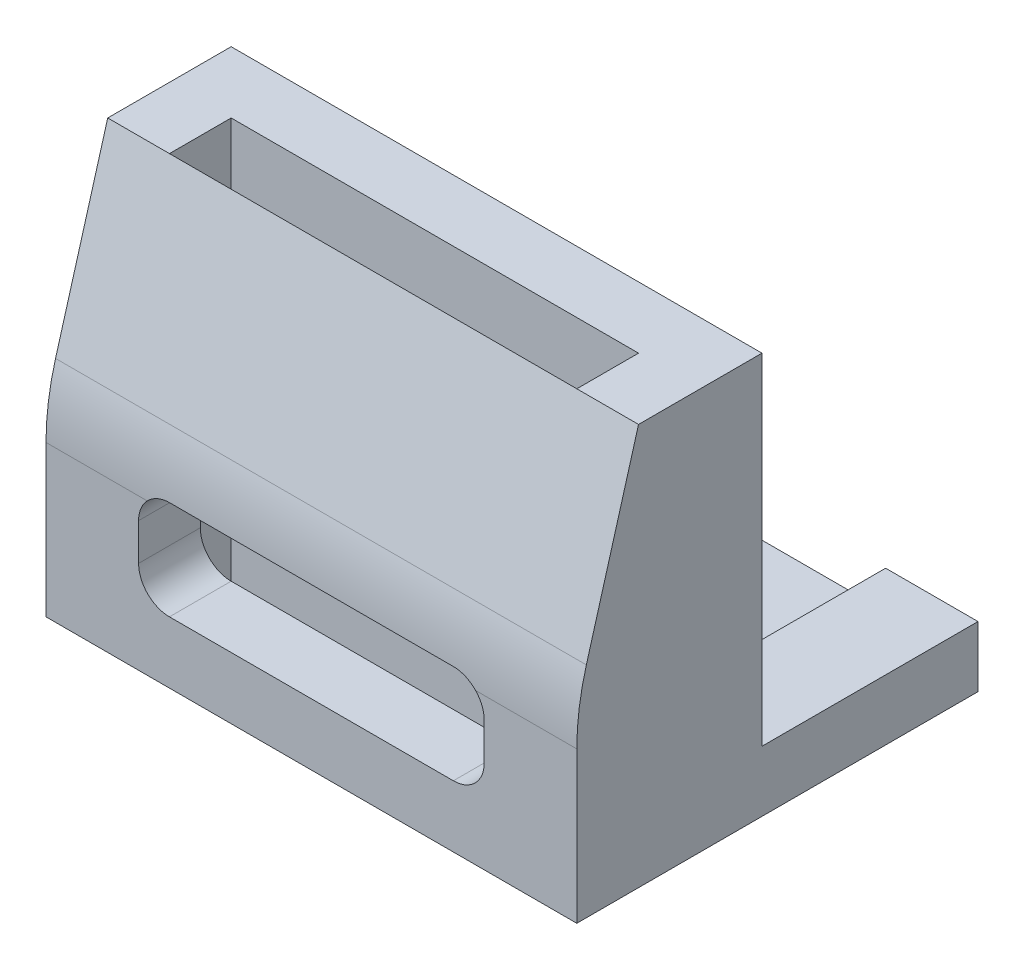
ISO-10303-21;
HEADER;
FILE_DESCRIPTION(('STEP AP214'),'2;1');
FILE_NAME('part.step','',(''),(''),'','','');
FILE_SCHEMA(('AUTOMOTIVE_DESIGN { 1 0 10303 214 1 1 1 1 }'));
ENDSEC;
DATA;
#1=APPLICATION_CONTEXT('core data for automotive mechanical design processes');
#2=APPLICATION_PROTOCOL_DEFINITION('international standard','automotive_design',2000,#1);
#3=PRODUCT_CONTEXT('',#1,'mechanical');
#4=PRODUCT('Part','Part','',(#3));
#5=PRODUCT_RELATED_PRODUCT_CATEGORY('part','',(#4));
#6=PRODUCT_DEFINITION_FORMATION('','',#4);
#7=PRODUCT_DEFINITION_CONTEXT('part definition',#1,'design');
#8=PRODUCT_DEFINITION('design','',#6,#7);
#9=PRODUCT_DEFINITION_SHAPE('','',#8);
#10=(LENGTH_UNIT() NAMED_UNIT(*) SI_UNIT(.MILLI.,.METRE.));
#11=(NAMED_UNIT(*) PLANE_ANGLE_UNIT() SI_UNIT($,.RADIAN.));
#12=(NAMED_UNIT(*) SI_UNIT($,.STERADIAN.) SOLID_ANGLE_UNIT());
#13=UNCERTAINTY_MEASURE_WITH_UNIT(LENGTH_MEASURE(1.E-05),#10,'distance_accuracy_value','');
#14=(GEOMETRIC_REPRESENTATION_CONTEXT(3) GLOBAL_UNCERTAINTY_ASSIGNED_CONTEXT((#13)) GLOBAL_UNIT_ASSIGNED_CONTEXT((#10,
#11,#12)) REPRESENTATION_CONTEXT('',''));
#15=CARTESIAN_POINT('',(0.,0.,0.));
#16=DIRECTION('',(0.,0.,1.));
#17=DIRECTION('',(1.,0.,0.));
#18=AXIS2_PLACEMENT_3D('',#15,#16,#17);
#19=CARTESIAN_POINT('',(15.2,1.96895504732383,-11.));
#20=DIRECTION('',(0.,-1.,0.));
#21=DIRECTION('',(0.,0.,-1.));
#22=AXIS2_PLACEMENT_3D('',#19,#20,#21);
#23=PLANE('',#22);
#24=DIRECTION('',(1.,0.,0.));
#25=VECTOR('',#24,1.);
#26=CARTESIAN_POINT('',(15.2,1.96895504732383,-4.));
#27=LINE('',#26,#25);
#28=CARTESIAN_POINT('',(-2.,1.96895504732383,-4.));
#29=VERTEX_POINT('',#28);
#30=CARTESIAN_POINT('',(1.,1.96895504732383,-4.));
#31=VERTEX_POINT('',#30);
#32=EDGE_CURVE('E493',#29,#31,#27,.T.);
#33=ORIENTED_EDGE('',*,*,#32,.T.);
#34=DIRECTION('',(0.,0.,-1.));
#35=VECTOR('',#34,1.);
#36=CARTESIAN_POINT('',(1.,1.96895504732383,-11.));
#37=LINE('',#36,#35);
#38=CARTESIAN_POINT('',(1.,1.96895504732383,-11.));
#39=VERTEX_POINT('',#38);
#40=EDGE_CURVE('E479',#31,#39,#37,.T.);
#41=ORIENTED_EDGE('',*,*,#40,.T.);
#42=DIRECTION('',(1.,0.,0.));
#43=VECTOR('',#42,1.);
#44=CARTESIAN_POINT('',(15.2,1.96895504732383,-11.));
#45=LINE('',#44,#43);
#46=CARTESIAN_POINT('',(-2.,1.96895504732383,-11.));
#47=VERTEX_POINT('',#46);
#48=EDGE_CURVE('E501',#47,#39,#45,.T.);
#49=ORIENTED_EDGE('',*,*,#48,.F.);
#50=DIRECTION('',(0.,0.,1.));
#51=VECTOR('',#50,1.);
#52=CARTESIAN_POINT('',(-2.,1.96895504732383,-11.));
#53=LINE('',#52,#51);
#54=EDGE_CURVE('E440',#47,#29,#53,.T.);
#55=ORIENTED_EDGE('',*,*,#54,.T.);
#56=EDGE_LOOP('',(#33,#41,#49,#55));
#57=FACE_BOUND('',#56,.T.);
#58=ADVANCED_FACE('F39',(#57),#23,.F.);
#59=CARTESIAN_POINT('',(-2.,13.,-4.));
#60=DIRECTION('',(0.,0.,1.));
#61=DIRECTION('',(1.,0.,0.));
#62=AXIS2_PLACEMENT_3D('',#59,#60,#61);
#63=PLANE('',#62);
#64=DIRECTION('',(0.,1.,0.));
#65=VECTOR('',#64,1.);
#66=CARTESIAN_POINT('',(1.,0.752448814893286,-4.));
#67=LINE('',#66,#65);
#68=CARTESIAN_POINT('',(1.,0.752448814893286,-4.));
#69=VERTEX_POINT('',#68);
#70=EDGE_CURVE('E467',#69,#31,#67,.T.);
#71=ORIENTED_EDGE('',*,*,#70,.T.);
#72=ORIENTED_EDGE('',*,*,#32,.F.);
#73=DIRECTION('',(0.,-1.,0.));
#74=VECTOR('',#73,1.);
#75=CARTESIAN_POINT('',(-2.,13.,-4.));
#76=LINE('',#75,#74);
#77=CARTESIAN_POINT('',(-2.,13.,-4.));
#78=VERTEX_POINT('',#77);
#79=EDGE_CURVE('E316',#78,#29,#76,.T.);
#80=ORIENTED_EDGE('',*,*,#79,.F.);
#81=DIRECTION('',(-1.,0.,0.));
#82=VECTOR('',#81,1.);
#83=CARTESIAN_POINT('',(-2.,13.,-4.));
#84=LINE('',#83,#82);
#85=CARTESIAN_POINT('',(15.2,13.,-4.));
#86=VERTEX_POINT('',#85);
#87=EDGE_CURVE('E295',#86,#78,#84,.T.);
#88=ORIENTED_EDGE('',*,*,#87,.F.);
#89=DIRECTION('',(0.,-1.,0.));
#90=VECTOR('',#89,1.);
#91=CARTESIAN_POINT('',(15.2,13.,-4.));
#92=LINE('',#91,#90);
#93=CARTESIAN_POINT('',(15.2,1.96895504732383,-4.));
#94=VERTEX_POINT('',#93);
#95=EDGE_CURVE('E286',#86,#94,#92,.T.);
#96=ORIENTED_EDGE('',*,*,#95,.T.);
#97=CARTESIAN_POINT('',(12.2065069842452,1.96895504732383,-4.));
#98=VERTEX_POINT('',#97);
#99=EDGE_CURVE('E487',#98,#94,#27,.T.);
#100=ORIENTED_EDGE('',*,*,#99,.F.);
#101=DIRECTION('',(0.,-1.,0.));
#102=VECTOR('',#101,1.);
#103=CARTESIAN_POINT('',(12.2065069842452,0.752448814893286,-4.));
#104=LINE('',#103,#102);
#105=CARTESIAN_POINT('',(12.2065069842452,0.752448814893286,-4.));
#106=VERTEX_POINT('',#105);
#107=EDGE_CURVE('E464',#98,#106,#104,.T.);
#108=ORIENTED_EDGE('',*,*,#107,.T.);
#109=DIRECTION('',(-1.,0.,0.));
#110=VECTOR('',#109,1.);
#111=CARTESIAN_POINT('',(12.2065069842452,0.752448814893286,-4.));
#112=LINE('',#111,#110);
#113=EDGE_CURVE('E458',#106,#69,#112,.T.);
#114=ORIENTED_EDGE('',*,*,#113,.T.);
#115=EDGE_LOOP('',(#71,#72,#80,#88,#96,#100,#108,#114));
#116=FACE_BOUND('',#115,.T.);
#117=DIRECTION('',(0.,1.,0.));
#118=VECTOR('',#117,1.);
#119=CARTESIAN_POINT('',(12.2,13.,-4.));
#120=LINE('',#119,#118);
#121=CARTESIAN_POINT('',(12.2,3.,-4.));
#122=VERTEX_POINT('',#121);
#123=CARTESIAN_POINT('',(12.2,4.2,-4.));
#124=VERTEX_POINT('',#123);
#125=EDGE_CURVE('E597',#122,#124,#120,.T.);
#126=ORIENTED_EDGE('',*,*,#125,.T.);
#127=CARTESIAN_POINT('',(11.2,4.2,-4.));
#128=DIRECTION('',(0.,0.,1.));
#129=DIRECTION('',(1.,0.,0.));
#130=AXIS2_PLACEMENT_3D('',#127,#128,#129);
#131=CIRCLE('',#130,1.);
#132=CARTESIAN_POINT('',(11.2,5.2,-4.));
#133=VERTEX_POINT('',#132);
#134=EDGE_CURVE('E603',#124,#133,#131,.T.);
#135=ORIENTED_EDGE('',*,*,#134,.T.);
#136=DIRECTION('',(1.,0.,0.));
#137=VECTOR('',#136,1.);
#138=CARTESIAN_POINT('',(-2.,5.2,-4.));
#139=LINE('',#138,#137);
#140=CARTESIAN_POINT('',(2.,5.2,-4.));
#141=VERTEX_POINT('',#140);
#142=EDGE_CURVE('E611',#141,#133,#139,.T.);
#143=ORIENTED_EDGE('',*,*,#142,.F.);
#144=CARTESIAN_POINT('',(2.,4.2,-4.));
#145=DIRECTION('',(0.,0.,1.));
#146=DIRECTION('',(1.,0.,0.));
#147=AXIS2_PLACEMENT_3D('',#144,#145,#146);
#148=CIRCLE('',#147,1.);
#149=CARTESIAN_POINT('',(1.,4.2,-4.));
#150=VERTEX_POINT('',#149);
#151=EDGE_CURVE('E617',#141,#150,#148,.T.);
#152=ORIENTED_EDGE('',*,*,#151,.T.);
#153=DIRECTION('',(0.,-1.,0.));
#154=VECTOR('',#153,1.);
#155=CARTESIAN_POINT('',(1.,13.,-4.));
#156=LINE('',#155,#154);
#157=CARTESIAN_POINT('',(1.,3.,-4.));
#158=VERTEX_POINT('',#157);
#159=EDGE_CURVE('E569',#150,#158,#156,.T.);
#160=ORIENTED_EDGE('',*,*,#159,.T.);
#161=CARTESIAN_POINT('',(2.,3.,-4.));
#162=DIRECTION('',(0.,0.,1.));
#163=DIRECTION('',(1.,0.,0.));
#164=AXIS2_PLACEMENT_3D('',#161,#162,#163);
#165=CIRCLE('',#164,1.);
#166=CARTESIAN_POINT('',(2.,2.,-4.));
#167=VERTEX_POINT('',#166);
#168=EDGE_CURVE('E576',#158,#167,#165,.T.);
#169=ORIENTED_EDGE('',*,*,#168,.T.);
#170=DIRECTION('',(1.,0.,0.));
#171=VECTOR('',#170,1.);
#172=CARTESIAN_POINT('',(-2.,2.,-4.));
#173=LINE('',#172,#171);
#174=CARTESIAN_POINT('',(11.2,2.,-4.));
#175=VERTEX_POINT('',#174);
#176=EDGE_CURVE('E583',#167,#175,#173,.T.);
#177=ORIENTED_EDGE('',*,*,#176,.T.);
#178=CARTESIAN_POINT('',(11.2,3.,-4.));
#179=DIRECTION('',(0.,0.,1.));
#180=DIRECTION('',(1.,0.,0.));
#181=AXIS2_PLACEMENT_3D('',#178,#179,#180);
#182=CIRCLE('',#181,1.);
#183=EDGE_CURVE('E590',#175,#122,#182,.T.);
#184=ORIENTED_EDGE('',*,*,#183,.T.);
#185=EDGE_LOOP('',(#126,#135,#143,#152,#160,#169,#177,#184));
#186=FACE_BOUND('',#185,.T.);
#187=ADVANCED_FACE('F664',(#116,#186),#63,.F.);
#188=CARTESIAN_POINT('',(0.,13.,0.));
#189=DIRECTION('',(0.,-1.,0.));
#190=DIRECTION('',(0.,0.,-1.));
#191=AXIS2_PLACEMENT_3D('',#188,#189,#190);
#192=PLANE('',#191);
#193=DIRECTION('',(0.,0.,1.));
#194=VECTOR('',#193,1.);
#195=CARTESIAN_POINT('',(-2.,13.,2.));
#196=LINE('',#195,#194);
#197=CARTESIAN_POINT('',(-2.,13.,0.));
#198=VERTEX_POINT('',#197);
#199=EDGE_CURVE('E289',#78,#198,#196,.T.);
#200=ORIENTED_EDGE('',*,*,#199,.T.);
#201=DIRECTION('',(1.,0.,0.));
#202=VECTOR('',#201,1.);
#203=CARTESIAN_POINT('',(-9.2636209694655,13.,0.));
#204=LINE('',#203,#202);
#205=CARTESIAN_POINT('',(0.,13.,0.));
#206=VERTEX_POINT('',#205);
#207=EDGE_CURVE('E281',#198,#206,#204,.T.);
#208=ORIENTED_EDGE('',*,*,#207,.T.);
#209=DIRECTION('',(0.,0.,1.));
#210=VECTOR('',#209,1.);
#211=CARTESIAN_POINT('',(0.,13.,0.));
#212=LINE('',#211,#210);
#213=CARTESIAN_POINT('',(0.,13.,-2.));
#214=VERTEX_POINT('',#213);
#215=EDGE_CURVE('E622',#214,#206,#212,.T.);
#216=ORIENTED_EDGE('',*,*,#215,.F.);
#217=DIRECTION('',(-1.,0.,0.));
#218=VECTOR('',#217,1.);
#219=CARTESIAN_POINT('',(0.,13.,-2.));
#220=LINE('',#219,#218);
#221=CARTESIAN_POINT('',(13.2,13.,-2.));
#222=VERTEX_POINT('',#221);
#223=EDGE_CURVE('E632',#222,#214,#220,.T.);
#224=ORIENTED_EDGE('',*,*,#223,.F.);
#225=DIRECTION('',(0.,0.,-1.));
#226=VECTOR('',#225,1.);
#227=CARTESIAN_POINT('',(13.2,13.,-2.));
#228=LINE('',#227,#226);
#229=CARTESIAN_POINT('',(13.2,13.,0.));
#230=VERTEX_POINT('',#229);
#231=EDGE_CURVE('E279',#230,#222,#228,.T.);
#232=ORIENTED_EDGE('',*,*,#231,.F.);
#233=CARTESIAN_POINT('',(15.2,13.,0.));
#234=VERTEX_POINT('',#233);
#235=EDGE_CURVE('E262',#230,#234,#204,.T.);
#236=ORIENTED_EDGE('',*,*,#235,.T.);
#237=DIRECTION('',(0.,0.,-1.));
#238=VECTOR('',#237,1.);
#239=CARTESIAN_POINT('',(15.2,13.,-4.));
#240=LINE('',#239,#238);
#241=EDGE_CURVE('E275',#234,#86,#240,.T.);
#242=ORIENTED_EDGE('',*,*,#241,.T.);
#243=ORIENTED_EDGE('',*,*,#87,.T.);
#244=EDGE_LOOP('',(#200,#208,#216,#224,#232,#236,#242,#243));
#245=FACE_BOUND('',#244,.T.);
#246=ADVANCED_FACE('F273',(#245),#192,.F.);
#247=CARTESIAN_POINT('',(0.,0.,0.));
#248=DIRECTION('',(0.,-1.,0.));
#249=DIRECTION('',(0.,0.,-1.));
#250=AXIS2_PLACEMENT_3D('',#247,#248,#249);
#251=PLANE('',#250);
#252=CARTESIAN_POINT('',(6.6,0.,-7.5));
#253=DIRECTION('',(0.,-1.,0.));
#254=DIRECTION('',(0.,0.,-1.));
#255=AXIS2_PLACEMENT_3D('',#252,#253,#254);
#256=CIRCLE('',#255,1.6);
#257=CARTESIAN_POINT('',(6.6,0.,-9.1));
#258=VERTEX_POINT('',#257);
#259=EDGE_CURVE('E483',#258,#258,#256,.T.);
#260=ORIENTED_EDGE('',*,*,#259,.F.);
#261=EDGE_LOOP('',(#260));
#262=FACE_BOUND('',#261,.T.);
#263=DIRECTION('',(0.,0.,1.));
#264=VECTOR('',#263,1.);
#265=CARTESIAN_POINT('',(-2.,0.,2.));
#266=LINE('',#265,#264);
#267=CARTESIAN_POINT('',(-2.,0.,-11.));
#268=VERTEX_POINT('',#267);
#269=CARTESIAN_POINT('',(-2.,0.,2.));
#270=VERTEX_POINT('',#269);
#271=EDGE_CURVE('E299',#268,#270,#266,.T.);
#272=ORIENTED_EDGE('',*,*,#271,.F.);
#273=DIRECTION('',(-1.,0.,0.));
#274=VECTOR('',#273,1.);
#275=CARTESIAN_POINT('',(15.2,0.,-11.));
#276=LINE('',#275,#274);
#277=CARTESIAN_POINT('',(15.2,0.,-11.));
#278=VERTEX_POINT('',#277);
#279=EDGE_CURVE('E492',#278,#268,#276,.T.);
#280=ORIENTED_EDGE('',*,*,#279,.F.);
#281=DIRECTION('',(0.,0.,-1.));
#282=VECTOR('',#281,1.);
#283=CARTESIAN_POINT('',(15.2,0.,-4.));
#284=LINE('',#283,#282);
#285=CARTESIAN_POINT('',(15.2,0.,2.));
#286=VERTEX_POINT('',#285);
#287=EDGE_CURVE('E308',#286,#278,#284,.T.);
#288=ORIENTED_EDGE('',*,*,#287,.F.);
#289=DIRECTION('',(1.,0.,0.));
#290=VECTOR('',#289,1.);
#291=CARTESIAN_POINT('',(-2.,0.,2.));
#292=LINE('',#291,#290);
#293=EDGE_CURVE('E303',#270,#286,#292,.T.);
#294=ORIENTED_EDGE('',*,*,#293,.F.);
#295=EDGE_LOOP('',(#272,#280,#288,#294));
#296=FACE_BOUND('',#295,.T.);
#297=DIRECTION('',(-1.,0.,0.));
#298=VECTOR('',#297,1.);
#299=CARTESIAN_POINT('',(0.,0.,-2.));
#300=LINE('',#299,#298);
#301=CARTESIAN_POINT('',(13.2,0.,-2.));
#302=VERTEX_POINT('',#301);
#303=CARTESIAN_POINT('',(0.,0.,-2.));
#304=VERTEX_POINT('',#303);
#305=EDGE_CURVE('E627',#302,#304,#300,.T.);
#306=ORIENTED_EDGE('',*,*,#305,.T.);
#307=DIRECTION('',(0.,0.,1.));
#308=VECTOR('',#307,1.);
#309=CARTESIAN_POINT('',(0.,0.,0.));
#310=LINE('',#309,#308);
#311=CARTESIAN_POINT('',(0.,0.,0.));
#312=VERTEX_POINT('',#311);
#313=EDGE_CURVE('E621',#304,#312,#310,.T.);
#314=ORIENTED_EDGE('',*,*,#313,.T.);
#315=DIRECTION('',(1.,0.,0.));
#316=VECTOR('',#315,1.);
#317=CARTESIAN_POINT('',(0.,0.,0.));
#318=LINE('',#317,#316);
#319=CARTESIAN_POINT('',(13.2,0.,0.));
#320=VERTEX_POINT('',#319);
#321=EDGE_CURVE('E639',#312,#320,#318,.T.);
#322=ORIENTED_EDGE('',*,*,#321,.T.);
#323=DIRECTION('',(0.,0.,-1.));
#324=VECTOR('',#323,1.);
#325=CARTESIAN_POINT('',(13.2,0.,-2.));
#326=LINE('',#325,#324);
#327=EDGE_CURVE('E643',#320,#302,#326,.T.);
#328=ORIENTED_EDGE('',*,*,#327,.T.);
#329=EDGE_LOOP('',(#306,#314,#322,#328));
#330=FACE_BOUND('',#329,.T.);
#331=ADVANCED_FACE('F678',(#262,#296,#330),#251,.T.);
#332=CARTESIAN_POINT('',(-2.,13.,2.));
#333=DIRECTION('',(1.,0.,0.));
#334=DIRECTION('',(0.,0.,-1.));
#335=AXIS2_PLACEMENT_3D('',#332,#333,#334);
#336=PLANE('',#335);
#337=DIRECTION('',(0.,-1.,0.));
#338=VECTOR('',#337,1.);
#339=CARTESIAN_POINT('',(-2.,13.,2.));
#340=LINE('',#339,#338);
#341=CARTESIAN_POINT('',(-2.,4.89406514808561,2.));
#342=VERTEX_POINT('',#341);
#343=EDGE_CURVE('E313',#342,#270,#340,.T.);
#344=ORIENTED_EDGE('',*,*,#343,.F.);
#345=CARTESIAN_POINT('',(-2.,4.8940651480856,-6.));
#346=DIRECTION('',(1.,0.,0.));
#347=DIRECTION('',(0.,0.,-1.));
#348=AXIS2_PLACEMENT_3D('',#345,#346,#347);
#349=CIRCLE('',#348,8.);
#350=CARTESIAN_POINT('',(-2.,7.09682325829814,1.69076437734852));
#351=VERTEX_POINT('',#350);
#352=EDGE_CURVE('E11',#342,#351,#349,.F.);
#353=ORIENTED_EDGE('',*,*,#352,.T.);
#354=DIRECTION('',(0.,-0.961345547168564,0.275344763776568));
#355=VECTOR('',#354,1.);
#356=CARTESIAN_POINT('',(-2.,13.,0.));
#357=LINE('',#356,#355);
#358=EDGE_CURVE('E446',#198,#351,#357,.T.);
#359=ORIENTED_EDGE('',*,*,#358,.F.);
#360=ORIENTED_EDGE('',*,*,#199,.F.);
#361=ORIENTED_EDGE('',*,*,#79,.T.);
#362=ORIENTED_EDGE('',*,*,#54,.F.);
#363=DIRECTION('',(0.,1.,0.));
#364=VECTOR('',#363,1.);
#365=CARTESIAN_POINT('',(-2.,0.,-11.));
#366=LINE('',#365,#364);
#367=EDGE_CURVE('E497',#268,#47,#366,.T.);
#368=ORIENTED_EDGE('',*,*,#367,.F.);
#369=ORIENTED_EDGE('',*,*,#271,.T.);
#370=EDGE_LOOP('',(#344,#353,#359,#360,#361,#362,#368,#369));
#371=FACE_BOUND('',#370,.T.);
#372=ADVANCED_FACE('F445',(#371),#336,.F.);
#373=CARTESIAN_POINT('',(-2.,13.,2.));
#374=DIRECTION('',(0.,0.,-1.));
#375=DIRECTION('',(-1.,0.,0.));
#376=AXIS2_PLACEMENT_3D('',#373,#374,#375);
#377=PLANE('',#376);
#378=DIRECTION('',(0.,-1.,0.));
#379=VECTOR('',#378,1.);
#380=CARTESIAN_POINT('',(15.2,13.,2.));
#381=LINE('',#380,#379);
#382=CARTESIAN_POINT('',(15.2,4.89406514808561,2.));
#383=VERTEX_POINT('',#382);
#384=EDGE_CURVE('E293',#383,#286,#381,.T.);
#385=ORIENTED_EDGE('',*,*,#384,.F.);
#386=DIRECTION('',(1.,0.,0.));
#387=VECTOR('',#386,1.);
#388=CARTESIAN_POINT('',(-2.,4.89406514808561,2.));
#389=LINE('',#388,#387);
#390=CARTESIAN_POINT('',(11.9199121961829,4.89406514808561,2.));
#391=VERTEX_POINT('',#390);
#392=EDGE_CURVE('E364',#383,#391,#389,.F.);
#393=ORIENTED_EDGE('',*,*,#392,.T.);
#394=CARTESIAN_POINT('',(11.2,4.2,2.));
#395=DIRECTION('',(0.,0.,1.));
#396=DIRECTION('',(1.,0.,0.));
#397=AXIS2_PLACEMENT_3D('',#394,#395,#396);
#398=CIRCLE('',#397,1.);
#399=CARTESIAN_POINT('',(12.2,4.2,2.));
#400=VERTEX_POINT('',#399);
#401=EDGE_CURVE('E532',#400,#391,#398,.T.);
#402=ORIENTED_EDGE('',*,*,#401,.F.);
#403=DIRECTION('',(0.,1.,0.));
#404=VECTOR('',#403,1.);
#405=CARTESIAN_POINT('',(12.2,3.,2.));
#406=LINE('',#405,#404);
#407=CARTESIAN_POINT('',(12.2,3.,2.));
#408=VERTEX_POINT('',#407);
#409=EDGE_CURVE('E528',#408,#400,#406,.T.);
#410=ORIENTED_EDGE('',*,*,#409,.F.);
#411=CARTESIAN_POINT('',(11.2,3.,2.));
#412=DIRECTION('',(0.,0.,1.));
#413=DIRECTION('',(1.,0.,0.));
#414=AXIS2_PLACEMENT_3D('',#411,#412,#413);
#415=CIRCLE('',#414,1.);
#416=CARTESIAN_POINT('',(11.2,2.,2.));
#417=VERTEX_POINT('',#416);
#418=EDGE_CURVE('E524',#417,#408,#415,.T.);
#419=ORIENTED_EDGE('',*,*,#418,.F.);
#420=DIRECTION('',(1.,0.,0.));
#421=VECTOR('',#420,1.);
#422=CARTESIAN_POINT('',(2.,2.,2.));
#423=LINE('',#422,#421);
#424=CARTESIAN_POINT('',(2.,2.,2.));
#425=VERTEX_POINT('',#424);
#426=EDGE_CURVE('E520',#425,#417,#423,.T.);
#427=ORIENTED_EDGE('',*,*,#426,.F.);
#428=CARTESIAN_POINT('',(2.,3.,2.));
#429=DIRECTION('',(0.,0.,1.));
#430=DIRECTION('',(1.,0.,0.));
#431=AXIS2_PLACEMENT_3D('',#428,#429,#430);
#432=CIRCLE('',#431,1.);
#433=CARTESIAN_POINT('',(1.,3.,2.));
#434=VERTEX_POINT('',#433);
#435=EDGE_CURVE('E516',#434,#425,#432,.T.);
#436=ORIENTED_EDGE('',*,*,#435,.F.);
#437=DIRECTION('',(0.,-1.,0.));
#438=VECTOR('',#437,1.);
#439=CARTESIAN_POINT('',(1.,4.2,2.));
#440=LINE('',#439,#438);
#441=CARTESIAN_POINT('',(1.,4.2,2.));
#442=VERTEX_POINT('',#441);
#443=EDGE_CURVE('E438',#442,#434,#440,.T.);
#444=ORIENTED_EDGE('',*,*,#443,.F.);
#445=CARTESIAN_POINT('',(2.,4.2,2.));
#446=DIRECTION('',(0.,0.,1.));
#447=DIRECTION('',(1.,0.,0.));
#448=AXIS2_PLACEMENT_3D('',#445,#446,#447);
#449=CIRCLE('',#448,1.);
#450=CARTESIAN_POINT('',(1.28008780381709,4.89406514808561,2.));
#451=VERTEX_POINT('',#450);
#452=EDGE_CURVE('E426',#451,#442,#449,.T.);
#453=ORIENTED_EDGE('',*,*,#452,.F.);
#454=DIRECTION('',(1.,0.,0.));
#455=VECTOR('',#454,1.);
#456=CARTESIAN_POINT('',(-2.,4.89406514808561,2.));
#457=LINE('',#456,#455);
#458=EDGE_CURVE('E361',#451,#342,#457,.F.);
#459=ORIENTED_EDGE('',*,*,#458,.T.);
#460=ORIENTED_EDGE('',*,*,#343,.T.);
#461=ORIENTED_EDGE('',*,*,#293,.T.);
#462=EDGE_LOOP('',(#385,#393,#402,#410,#419,#427,#436,#444,#453,#459,#460,#461));
#463=FACE_BOUND('',#462,.T.);
#464=ADVANCED_FACE('F434',(#463),#377,.F.);
#465=CARTESIAN_POINT('',(15.2,13.,-4.));
#466=DIRECTION('',(-1.,0.,0.));
#467=DIRECTION('',(0.,0.,1.));
#468=AXIS2_PLACEMENT_3D('',#465,#466,#467);
#469=PLANE('',#468);
#470=DIRECTION('',(0.,0.961345547168564,-0.275344763776568));
#471=VECTOR('',#470,1.);
#472=CARTESIAN_POINT('',(15.2,13.,0.));
#473=LINE('',#472,#471);
#474=CARTESIAN_POINT('',(15.2,7.09682325829814,1.69076437734852));
#475=VERTEX_POINT('',#474);
#476=EDGE_CURVE('E258',#475,#234,#473,.T.);
#477=ORIENTED_EDGE('',*,*,#476,.F.);
#478=CARTESIAN_POINT('',(15.2,4.8940651480856,-6.));
#479=DIRECTION('',(-1.,0.,0.));
#480=DIRECTION('',(0.,0.,1.));
#481=AXIS2_PLACEMENT_3D('',#478,#479,#480);
#482=CIRCLE('',#481,8.);
#483=EDGE_CURVE('E358',#475,#383,#482,.F.);
#484=ORIENTED_EDGE('',*,*,#483,.T.);
#485=ORIENTED_EDGE('',*,*,#384,.T.);
#486=ORIENTED_EDGE('',*,*,#287,.T.);
#487=DIRECTION('',(0.,-1.,0.));
#488=VECTOR('',#487,1.);
#489=CARTESIAN_POINT('',(15.2,0.,-11.));
#490=LINE('',#489,#488);
#491=CARTESIAN_POINT('',(15.2,1.96895504732383,-11.));
#492=VERTEX_POINT('',#491);
#493=EDGE_CURVE('E488',#492,#278,#490,.T.);
#494=ORIENTED_EDGE('',*,*,#493,.F.);
#495=DIRECTION('',(0.,0.,1.));
#496=VECTOR('',#495,1.);
#497=CARTESIAN_POINT('',(15.2,1.96895504732383,-11.));
#498=LINE('',#497,#496);
#499=EDGE_CURVE('E505',#492,#94,#498,.T.);
#500=ORIENTED_EDGE('',*,*,#499,.T.);
#501=ORIENTED_EDGE('',*,*,#95,.F.);
#502=ORIENTED_EDGE('',*,*,#241,.F.);
#503=EDGE_LOOP('',(#477,#484,#485,#486,#494,#500,#501,#502));
#504=FACE_BOUND('',#503,.T.);
#505=ADVANCED_FACE('F283',(#504),#469,.F.);
#506=CARTESIAN_POINT('',(0.,13.,0.));
#507=DIRECTION('',(1.,0.,0.));
#508=DIRECTION('',(0.,0.,-1.));
#509=AXIS2_PLACEMENT_3D('',#506,#507,#508);
#510=PLANE('',#509);
#511=ORIENTED_EDGE('',*,*,#313,.F.);
#512=DIRECTION('',(0.,-1.,0.));
#513=VECTOR('',#512,1.);
#514=CARTESIAN_POINT('',(0.,13.,-2.));
#515=LINE('',#514,#513);
#516=EDGE_CURVE('E635',#214,#304,#515,.T.);
#517=ORIENTED_EDGE('',*,*,#516,.F.);
#518=ORIENTED_EDGE('',*,*,#215,.T.);
#519=DIRECTION('',(0.,-1.,0.));
#520=VECTOR('',#519,1.);
#521=CARTESIAN_POINT('',(0.,13.,0.));
#522=LINE('',#521,#520);
#523=EDGE_CURVE('E304',#206,#312,#522,.T.);
#524=ORIENTED_EDGE('',*,*,#523,.T.);
#525=EDGE_LOOP('',(#511,#517,#518,#524));
#526=FACE_BOUND('',#525,.T.);
#527=ADVANCED_FACE('F924',(#526),#510,.T.);
#528=CARTESIAN_POINT('',(0.,13.,0.));
#529=DIRECTION('',(0.,0.,-1.));
#530=DIRECTION('',(-1.,0.,0.));
#531=AXIS2_PLACEMENT_3D('',#528,#529,#530);
#532=PLANE('',#531);
#533=CARTESIAN_POINT('',(2.,4.2,0.));
#534=DIRECTION('',(0.,0.,-1.));
#535=DIRECTION('',(-1.,0.,0.));
#536=AXIS2_PLACEMENT_3D('',#533,#534,#535);
#537=CIRCLE('',#536,1.);
#538=CARTESIAN_POINT('',(1.,4.2,0.));
#539=VERTEX_POINT('',#538);
#540=CARTESIAN_POINT('',(2.,5.2,0.));
#541=VERTEX_POINT('',#540);
#542=EDGE_CURVE('E614',#539,#541,#537,.T.);
#543=ORIENTED_EDGE('',*,*,#542,.F.);
#544=DIRECTION('',(0.,1.,0.));
#545=VECTOR('',#544,1.);
#546=CARTESIAN_POINT('',(1.,13.,0.));
#547=LINE('',#546,#545);
#548=CARTESIAN_POINT('',(1.,3.,0.));
#549=VERTEX_POINT('',#548);
#550=EDGE_CURVE('E566',#549,#539,#547,.T.);
#551=ORIENTED_EDGE('',*,*,#550,.F.);
#552=CARTESIAN_POINT('',(2.,3.,0.));
#553=DIRECTION('',(0.,0.,-1.));
#554=DIRECTION('',(-1.,0.,0.));
#555=AXIS2_PLACEMENT_3D('',#552,#553,#554);
#556=CIRCLE('',#555,1.);
#557=CARTESIAN_POINT('',(2.,2.,0.));
#558=VERTEX_POINT('',#557);
#559=EDGE_CURVE('E572',#558,#549,#556,.T.);
#560=ORIENTED_EDGE('',*,*,#559,.F.);
#561=DIRECTION('',(-1.,0.,0.));
#562=VECTOR('',#561,1.);
#563=CARTESIAN_POINT('',(0.,2.,0.));
#564=LINE('',#563,#562);
#565=CARTESIAN_POINT('',(11.2,2.,0.));
#566=VERTEX_POINT('',#565);
#567=EDGE_CURVE('E580',#566,#558,#564,.T.);
#568=ORIENTED_EDGE('',*,*,#567,.F.);
#569=CARTESIAN_POINT('',(11.2,3.,0.));
#570=DIRECTION('',(0.,0.,-1.));
#571=DIRECTION('',(-1.,0.,0.));
#572=AXIS2_PLACEMENT_3D('',#569,#570,#571);
#573=CIRCLE('',#572,1.);
#574=CARTESIAN_POINT('',(12.2,3.,0.));
#575=VERTEX_POINT('',#574);
#576=EDGE_CURVE('E587',#575,#566,#573,.T.);
#577=ORIENTED_EDGE('',*,*,#576,.F.);
#578=DIRECTION('',(0.,-1.,0.));
#579=VECTOR('',#578,1.);
#580=CARTESIAN_POINT('',(12.2,13.,0.));
#581=LINE('',#580,#579);
#582=CARTESIAN_POINT('',(12.2,4.2,0.));
#583=VERTEX_POINT('',#582);
#584=EDGE_CURVE('E594',#583,#575,#581,.T.);
#585=ORIENTED_EDGE('',*,*,#584,.F.);
#586=CARTESIAN_POINT('',(11.2,4.2,0.));
#587=DIRECTION('',(0.,0.,-1.));
#588=DIRECTION('',(-1.,0.,0.));
#589=AXIS2_PLACEMENT_3D('',#586,#587,#588);
#590=CIRCLE('',#589,1.);
#591=CARTESIAN_POINT('',(11.2,5.2,0.));
#592=VERTEX_POINT('',#591);
#593=EDGE_CURVE('E600',#592,#583,#590,.T.);
#594=ORIENTED_EDGE('',*,*,#593,.F.);
#595=DIRECTION('',(-1.,0.,0.));
#596=VECTOR('',#595,1.);
#597=CARTESIAN_POINT('',(0.,5.2,0.));
#598=LINE('',#597,#596);
#599=EDGE_CURVE('E607',#592,#541,#598,.T.);
#600=ORIENTED_EDGE('',*,*,#599,.T.);
#601=EDGE_LOOP('',(#543,#551,#560,#568,#577,#585,#594,#600));
#602=FACE_BOUND('',#601,.T.);
#603=ORIENTED_EDGE('',*,*,#321,.F.);
#604=ORIENTED_EDGE('',*,*,#523,.F.);
#605=DIRECTION('',(1.,0.,0.));
#606=VECTOR('',#605,1.);
#607=CARTESIAN_POINT('',(0.,13.,0.));
#608=LINE('',#607,#606);
#609=EDGE_CURVE('E626',#206,#230,#608,.T.);
#610=ORIENTED_EDGE('',*,*,#609,.T.);
#611=DIRECTION('',(0.,-1.,0.));
#612=VECTOR('',#611,1.);
#613=CARTESIAN_POINT('',(13.2,13.,0.));
#614=LINE('',#613,#612);
#615=EDGE_CURVE('E656',#230,#320,#614,.T.);
#616=ORIENTED_EDGE('',*,*,#615,.T.);
#617=EDGE_LOOP('',(#603,#604,#610,#616));
#618=FACE_BOUND('',#617,.T.);
#619=ADVANCED_FACE('F751',(#602,#618),#532,.T.);
#620=CARTESIAN_POINT('',(13.2,13.,-2.));
#621=DIRECTION('',(-1.,0.,0.));
#622=DIRECTION('',(0.,0.,1.));
#623=AXIS2_PLACEMENT_3D('',#620,#621,#622);
#624=PLANE('',#623);
#625=ORIENTED_EDGE('',*,*,#327,.F.);
#626=ORIENTED_EDGE('',*,*,#615,.F.);
#627=ORIENTED_EDGE('',*,*,#231,.T.);
#628=DIRECTION('',(0.,-1.,0.));
#629=VECTOR('',#628,1.);
#630=CARTESIAN_POINT('',(13.2,13.,-2.));
#631=LINE('',#630,#629);
#632=EDGE_CURVE('E653',#222,#302,#631,.T.);
#633=ORIENTED_EDGE('',*,*,#632,.T.);
#634=EDGE_LOOP('',(#625,#626,#627,#633));
#635=FACE_BOUND('',#634,.T.);
#636=ADVANCED_FACE('F940',(#635),#624,.T.);
#637=CARTESIAN_POINT('',(0.,13.,-2.));
#638=DIRECTION('',(0.,0.,1.));
#639=DIRECTION('',(1.,0.,0.));
#640=AXIS2_PLACEMENT_3D('',#637,#638,#639);
#641=PLANE('',#640);
#642=CARTESIAN_POINT('',(2.,4.2,-2.));
#643=DIRECTION('',(0.,0.,1.));
#644=DIRECTION('',(1.,0.,0.));
#645=AXIS2_PLACEMENT_3D('',#642,#643,#644);
#646=CIRCLE('',#645,1.);
#647=CARTESIAN_POINT('',(2.,5.2,-2.));
#648=VERTEX_POINT('',#647);
#649=CARTESIAN_POINT('',(1.,4.2,-2.));
#650=VERTEX_POINT('',#649);
#651=EDGE_CURVE('E342',#648,#650,#646,.T.);
#652=ORIENTED_EDGE('',*,*,#651,.F.);
#653=DIRECTION('',(1.,0.,0.));
#654=VECTOR('',#653,1.);
#655=CARTESIAN_POINT('',(0.,5.2,-2.));
#656=LINE('',#655,#654);
#657=CARTESIAN_POINT('',(11.2,5.2,-2.));
#658=VERTEX_POINT('',#657);
#659=EDGE_CURVE('E338',#648,#658,#656,.T.);
#660=ORIENTED_EDGE('',*,*,#659,.T.);
#661=CARTESIAN_POINT('',(11.2,4.2,-2.));
#662=DIRECTION('',(0.,0.,1.));
#663=DIRECTION('',(1.,0.,0.));
#664=AXIS2_PLACEMENT_3D('',#661,#662,#663);
#665=CIRCLE('',#664,1.);
#666=CARTESIAN_POINT('',(12.2,4.2,-2.));
#667=VERTEX_POINT('',#666);
#668=EDGE_CURVE('E335',#667,#658,#665,.T.);
#669=ORIENTED_EDGE('',*,*,#668,.F.);
#670=DIRECTION('',(0.,1.,0.));
#671=VECTOR('',#670,1.);
#672=CARTESIAN_POINT('',(12.2,13.,-2.));
#673=LINE('',#672,#671);
#674=CARTESIAN_POINT('',(12.2,3.,-2.));
#675=VERTEX_POINT('',#674);
#676=EDGE_CURVE('E332',#675,#667,#673,.T.);
#677=ORIENTED_EDGE('',*,*,#676,.F.);
#678=CARTESIAN_POINT('',(11.2,3.,-2.));
#679=DIRECTION('',(0.,0.,1.));
#680=DIRECTION('',(1.,0.,0.));
#681=AXIS2_PLACEMENT_3D('',#678,#679,#680);
#682=CIRCLE('',#681,1.);
#683=CARTESIAN_POINT('',(11.2,2.,-2.));
#684=VERTEX_POINT('',#683);
#685=EDGE_CURVE('E329',#684,#675,#682,.T.);
#686=ORIENTED_EDGE('',*,*,#685,.F.);
#687=DIRECTION('',(1.,0.,0.));
#688=VECTOR('',#687,1.);
#689=CARTESIAN_POINT('',(0.,2.,-2.));
#690=LINE('',#689,#688);
#691=CARTESIAN_POINT('',(2.,2.,-2.));
#692=VERTEX_POINT('',#691);
#693=EDGE_CURVE('E326',#692,#684,#690,.T.);
#694=ORIENTED_EDGE('',*,*,#693,.F.);
#695=CARTESIAN_POINT('',(2.,3.,-2.));
#696=DIRECTION('',(0.,0.,1.));
#697=DIRECTION('',(1.,0.,0.));
#698=AXIS2_PLACEMENT_3D('',#695,#696,#697);
#699=CIRCLE('',#698,1.);
#700=CARTESIAN_POINT('',(1.,3.,-2.));
#701=VERTEX_POINT('',#700);
#702=EDGE_CURVE('E323',#701,#692,#699,.T.);
#703=ORIENTED_EDGE('',*,*,#702,.F.);
#704=DIRECTION('',(0.,-1.,0.));
#705=VECTOR('',#704,1.);
#706=CARTESIAN_POINT('',(1.,13.,-2.));
#707=LINE('',#706,#705);
#708=EDGE_CURVE('E320',#650,#701,#707,.T.);
#709=ORIENTED_EDGE('',*,*,#708,.F.);
#710=EDGE_LOOP('',(#652,#660,#669,#677,#686,#694,#703,#709));
#711=FACE_BOUND('',#710,.T.);
#712=ORIENTED_EDGE('',*,*,#305,.F.);
#713=ORIENTED_EDGE('',*,*,#632,.F.);
#714=ORIENTED_EDGE('',*,*,#223,.T.);
#715=ORIENTED_EDGE('',*,*,#516,.T.);
#716=EDGE_LOOP('',(#712,#713,#714,#715));
#717=FACE_BOUND('',#716,.T.);
#718=ADVANCED_FACE('F406',(#711,#717),#641,.T.);
#719=CARTESIAN_POINT('',(1.,4.2,-11.));
#720=DIRECTION('',(-1.,0.,0.));
#721=DIRECTION('',(0.,-1.,0.));
#722=AXIS2_PLACEMENT_3D('',#719,#720,#721);
#723=PLANE('',#722);
#724=DIRECTION('',(0.,0.,1.));
#725=VECTOR('',#724,1.);
#726=CARTESIAN_POINT('',(1.,4.2,-11.));
#727=LINE('',#726,#725);
#728=EDGE_CURVE('E563',#150,#650,#727,.T.);
#729=ORIENTED_EDGE('',*,*,#728,.T.);
#730=ORIENTED_EDGE('',*,*,#708,.T.);
#731=DIRECTION('',(0.,0.,1.));
#732=VECTOR('',#731,1.);
#733=CARTESIAN_POINT('',(1.,3.,-11.));
#734=LINE('',#733,#732);
#735=EDGE_CURVE('E559',#158,#701,#734,.T.);
#736=ORIENTED_EDGE('',*,*,#735,.F.);
#737=ORIENTED_EDGE('',*,*,#159,.F.);
#738=EDGE_LOOP('',(#729,#730,#736,#737));
#739=FACE_BOUND('',#738,.T.);
#740=ADVANCED_FACE('F401',(#739),#723,.F.);
#741=CARTESIAN_POINT('',(2.,3.,-11.));
#742=DIRECTION('',(0.,0.,1.));
#743=DIRECTION('',(1.,0.,0.));
#744=AXIS2_PLACEMENT_3D('',#741,#742,#743);
#745=CYLINDRICAL_SURFACE('',#744,1.);
#746=ORIENTED_EDGE('',*,*,#735,.T.);
#747=ORIENTED_EDGE('',*,*,#702,.T.);
#748=DIRECTION('',(0.,0.,1.));
#749=VECTOR('',#748,1.);
#750=CARTESIAN_POINT('',(2.,2.,-11.));
#751=LINE('',#750,#749);
#752=EDGE_CURVE('E555',#167,#692,#751,.T.);
#753=ORIENTED_EDGE('',*,*,#752,.F.);
#754=ORIENTED_EDGE('',*,*,#168,.F.);
#755=EDGE_LOOP('',(#746,#747,#753,#754));
#756=FACE_BOUND('',#755,.T.);
#757=ADVANCED_FACE('F396',(#756),#745,.F.);
#758=CARTESIAN_POINT('',(2.,2.,-11.));
#759=DIRECTION('',(0.,-1.,0.));
#760=DIRECTION('',(0.,0.,-1.));
#761=AXIS2_PLACEMENT_3D('',#758,#759,#760);
#762=PLANE('',#761);
#763=ORIENTED_EDGE('',*,*,#752,.T.);
#764=ORIENTED_EDGE('',*,*,#693,.T.);
#765=DIRECTION('',(0.,0.,1.));
#766=VECTOR('',#765,1.);
#767=CARTESIAN_POINT('',(11.2,2.,-11.));
#768=LINE('',#767,#766);
#769=EDGE_CURVE('E551',#175,#684,#768,.T.);
#770=ORIENTED_EDGE('',*,*,#769,.F.);
#771=ORIENTED_EDGE('',*,*,#176,.F.);
#772=EDGE_LOOP('',(#763,#764,#770,#771));
#773=FACE_BOUND('',#772,.T.);
#774=ADVANCED_FACE('F391',(#773),#762,.F.);
#775=CARTESIAN_POINT('',(11.2,3.,-11.));
#776=DIRECTION('',(0.,0.,1.));
#777=DIRECTION('',(1.,0.,0.));
#778=AXIS2_PLACEMENT_3D('',#775,#776,#777);
#779=CYLINDRICAL_SURFACE('',#778,1.);
#780=ORIENTED_EDGE('',*,*,#769,.T.);
#781=ORIENTED_EDGE('',*,*,#685,.T.);
#782=DIRECTION('',(0.,0.,1.));
#783=VECTOR('',#782,1.);
#784=CARTESIAN_POINT('',(12.2,3.,-11.));
#785=LINE('',#784,#783);
#786=EDGE_CURVE('E547',#122,#675,#785,.T.);
#787=ORIENTED_EDGE('',*,*,#786,.F.);
#788=ORIENTED_EDGE('',*,*,#183,.F.);
#789=EDGE_LOOP('',(#780,#781,#787,#788));
#790=FACE_BOUND('',#789,.T.);
#791=ADVANCED_FACE('F386',(#790),#779,.F.);
#792=CARTESIAN_POINT('',(12.2,3.,-11.));
#793=DIRECTION('',(1.,0.,0.));
#794=DIRECTION('',(0.,0.,-1.));
#795=AXIS2_PLACEMENT_3D('',#792,#793,#794);
#796=PLANE('',#795);
#797=ORIENTED_EDGE('',*,*,#786,.T.);
#798=ORIENTED_EDGE('',*,*,#676,.T.);
#799=DIRECTION('',(0.,0.,1.));
#800=VECTOR('',#799,1.);
#801=CARTESIAN_POINT('',(12.2,4.2,-11.));
#802=LINE('',#801,#800);
#803=EDGE_CURVE('E543',#124,#667,#802,.T.);
#804=ORIENTED_EDGE('',*,*,#803,.F.);
#805=ORIENTED_EDGE('',*,*,#125,.F.);
#806=EDGE_LOOP('',(#797,#798,#804,#805));
#807=FACE_BOUND('',#806,.T.);
#808=ADVANCED_FACE('F380',(#807),#796,.F.);
#809=CARTESIAN_POINT('',(11.2,4.2,-11.));
#810=DIRECTION('',(0.,0.,1.));
#811=DIRECTION('',(1.,0.,0.));
#812=AXIS2_PLACEMENT_3D('',#809,#810,#811);
#813=CYLINDRICAL_SURFACE('',#812,1.);
#814=ORIENTED_EDGE('',*,*,#803,.T.);
#815=ORIENTED_EDGE('',*,*,#668,.T.);
#816=DIRECTION('',(0.,0.,1.));
#817=VECTOR('',#816,1.);
#818=CARTESIAN_POINT('',(11.2,5.2,-11.));
#819=LINE('',#818,#817);
#820=EDGE_CURVE('E539',#133,#658,#819,.T.);
#821=ORIENTED_EDGE('',*,*,#820,.F.);
#822=ORIENTED_EDGE('',*,*,#134,.F.);
#823=EDGE_LOOP('',(#814,#815,#821,#822));
#824=FACE_BOUND('',#823,.T.);
#825=ADVANCED_FACE('F374',(#824),#813,.F.);
#826=CARTESIAN_POINT('',(2.,5.2,-11.));
#827=DIRECTION('',(0.,-1.,0.));
#828=DIRECTION('',(0.,0.,-1.));
#829=AXIS2_PLACEMENT_3D('',#826,#827,#828);
#830=PLANE('',#829);
#831=ORIENTED_EDGE('',*,*,#142,.T.);
#832=ORIENTED_EDGE('',*,*,#820,.T.);
#833=ORIENTED_EDGE('',*,*,#659,.F.);
#834=DIRECTION('',(0.,0.,1.));
#835=VECTOR('',#834,1.);
#836=CARTESIAN_POINT('',(2.,5.2,-11.));
#837=LINE('',#836,#835);
#838=EDGE_CURVE('E538',#141,#648,#837,.T.);
#839=ORIENTED_EDGE('',*,*,#838,.F.);
#840=EDGE_LOOP('',(#831,#832,#833,#839));
#841=FACE_BOUND('',#840,.T.);
#842=ADVANCED_FACE('F379',(#841),#830,.T.);
#843=CARTESIAN_POINT('',(2.,4.2,-11.));
#844=DIRECTION('',(0.,0.,1.));
#845=DIRECTION('',(1.,0.,0.));
#846=AXIS2_PLACEMENT_3D('',#843,#844,#845);
#847=CYLINDRICAL_SURFACE('',#846,1.);
#848=ORIENTED_EDGE('',*,*,#838,.T.);
#849=ORIENTED_EDGE('',*,*,#651,.T.);
#850=ORIENTED_EDGE('',*,*,#728,.F.);
#851=ORIENTED_EDGE('',*,*,#151,.F.);
#852=EDGE_LOOP('',(#848,#849,#850,#851));
#853=FACE_BOUND('',#852,.T.);
#854=ADVANCED_FACE('F409',(#853),#847,.F.);
#855=CARTESIAN_POINT('',(2.,5.2,1.99414810135415));
#856=VERTEX_POINT('',#855);
#857=EDGE_CURVE('E428',#541,#856,#837,.T.);
#858=ORIENTED_EDGE('',*,*,#857,.T.);
#859=CARTESIAN_POINT('',(2.,5.2,1.99414810135415));
#860=CARTESIAN_POINT('',(1.97188822582488,5.19999963040088,1.99414725577299));
#861=CARTESIAN_POINT('',(1.94379025478832,5.19881377069174,1.99419359129783));
#862=CARTESIAN_POINT('',(1.88779451739721,5.19408269199803,1.99437288245707));
#863=CARTESIAN_POINT('',(1.85989674716929,5.19053751878514,1.99450583641105));
#864=CARTESIAN_POINT('',(1.77678457076585,5.17638440668374,1.99502286941063));
#865=CARTESIAN_POINT('',(1.72212708052524,5.16225885442642,1.99552513207933));
#866=CARTESIAN_POINT('',(1.61596089439409,5.12503351334145,1.99668663558357));
#867=CARTESIAN_POINT('',(1.56445434015192,5.10192769749289,1.99734598172897));
#868=CARTESIAN_POINT('',(1.4661113395823,5.04741421741754,1.99857619197346));
#869=CARTESIAN_POINT('',(1.41926644925727,5.01602195432909,1.9991472171347));
#870=CARTESIAN_POINT('',(1.35861259387695,4.96752105874373,1.99967404254918));
#871=CARTESIAN_POINT('',(1.34223530632333,4.95353185212927,1.9997921200997));
#872=CARTESIAN_POINT('',(1.31043827546536,4.92454511705167,1.9999550530575));
#873=CARTESIAN_POINT('',(1.295017287307,4.90954895473377,2.0000000056645));
#874=CARTESIAN_POINT('',(1.28008780381708,4.89406514808561,2.00000000000001));
#875=B_SPLINE_CURVE_WITH_KNOTS('',3,(#859,#860,#861,#862,#863,#864,#865,#866,#867,#868,#869,
#870,#871,#872,#873,#874),.UNSPECIFIED.,.F.,.F.,(4,2,2,2,2,2,2,4),(0.,0.0842828657773591,
0.168564096479209,0.337054825658767,0.50565883164944,0.673951651170435,0.738533607828565,
0.803029649996993),.UNSPECIFIED.);
#876=EDGE_CURVE('E49',#856,#451,#875,.T.);
#877=ORIENTED_EDGE('',*,*,#876,.T.);
#878=ORIENTED_EDGE('',*,*,#452,.T.);
#879=EDGE_CURVE('E535',#539,#442,#727,.T.);
#880=ORIENTED_EDGE('',*,*,#879,.F.);
#881=ORIENTED_EDGE('',*,*,#542,.T.);
#882=EDGE_LOOP('',(#858,#877,#878,#880,#881));
#883=FACE_BOUND('',#882,.T.);
#884=ADVANCED_FACE('F413',(#883),#847,.F.);
#885=CARTESIAN_POINT('',(11.2,5.2,1.99414810135415));
#886=VERTEX_POINT('',#885);
#887=EDGE_CURVE('E540',#592,#886,#819,.T.);
#888=ORIENTED_EDGE('',*,*,#887,.T.);
#889=DIRECTION('',(1.,0.,0.));
#890=VECTOR('',#889,1.);
#891=CARTESIAN_POINT('',(11.2,5.2,1.99414810135415));
#892=LINE('',#891,#890);
#893=EDGE_CURVE('E56',#886,#856,#892,.F.);
#894=ORIENTED_EDGE('',*,*,#893,.T.);
#895=ORIENTED_EDGE('',*,*,#857,.F.);
#896=ORIENTED_EDGE('',*,*,#599,.F.);
#897=EDGE_LOOP('',(#888,#894,#895,#896));
#898=FACE_BOUND('',#897,.T.);
#899=ADVANCED_FACE('F727',(#898),#830,.T.);
#900=ORIENTED_EDGE('',*,*,#401,.T.);
#901=CARTESIAN_POINT('',(11.9199121961829,4.89406514808561,2.));
#902=CARTESIAN_POINT('',(11.9004006988136,4.91430273085675,2.00000001243534));
#903=CARTESIAN_POINT('',(11.880045450618,4.9337074667705,1.99992321947624));
#904=CARTESIAN_POINT('',(11.837775740204,4.97073505754582,1.99965400827164));
#905=CARTESIAN_POINT('',(11.8158613167766,4.98835795671144,1.99946159290184));
#906=CARTESIAN_POINT('',(11.7479887687165,5.03836738393943,1.99876807136811));
#907=CARTESIAN_POINT('',(11.6998851312668,5.06791145214237,1.99815062737483));
#908=CARTESIAN_POINT('',(11.5994020118713,5.11850469318597,1.99689136656138));
#909=CARTESIAN_POINT('',(11.5470197297982,5.13954824850372,1.99624953392957));
#910=CARTESIAN_POINT('',(11.4395189030241,5.17251149661312,1.99516997526771));
#911=CARTESIAN_POINT('',(11.3844055913085,5.1844479706593,1.99473187441403));
#912=CARTESIAN_POINT('',(11.3073902335682,5.19445150633691,1.99435881289035));
#913=CARTESIAN_POINT('',(11.2859508212908,5.19653257323591,1.99428016600421));
#914=CARTESIAN_POINT('',(11.2430108174281,5.19930532093004,1.99417477785132));
#915=CARTESIAN_POINT('',(11.2215103451794,5.19999884644217,1.99414796767));
#916=CARTESIAN_POINT('',(11.2,5.2,1.99414810135416));
#917=B_SPLINE_CURVE_WITH_KNOTS('',3,(#901,#902,#903,#904,#905,#906,#907,#908,#909,#910,#911,
#912,#913,#914,#915,#916),.UNSPECIFIED.,.F.,.F.,(4,2,2,2,2,2,2,4),(0.,0.0842818629866323,
0.168561629851351,0.337051943409474,0.50565342153292,0.673943469081816,0.738529520517474,
0.803029648483598),.UNSPECIFIED.);
#918=EDGE_CURVE('E64',#391,#886,#917,.T.);
#919=ORIENTED_EDGE('',*,*,#918,.T.);
#920=ORIENTED_EDGE('',*,*,#887,.F.);
#921=ORIENTED_EDGE('',*,*,#593,.T.);
#922=EDGE_CURVE('E544',#583,#400,#802,.T.);
#923=ORIENTED_EDGE('',*,*,#922,.T.);
#924=EDGE_LOOP('',(#900,#919,#920,#921,#923));
#925=FACE_BOUND('',#924,.T.);
#926=ADVANCED_FACE('F382',(#925),#813,.F.);
#927=ORIENTED_EDGE('',*,*,#584,.T.);
#928=EDGE_CURVE('E548',#575,#408,#785,.T.);
#929=ORIENTED_EDGE('',*,*,#928,.T.);
#930=ORIENTED_EDGE('',*,*,#409,.T.);
#931=ORIENTED_EDGE('',*,*,#922,.F.);
#932=EDGE_LOOP('',(#927,#929,#930,#931));
#933=FACE_BOUND('',#932,.T.);
#934=ADVANCED_FACE('F388',(#933),#796,.F.);
#935=ORIENTED_EDGE('',*,*,#576,.T.);
#936=EDGE_CURVE('E552',#566,#417,#768,.T.);
#937=ORIENTED_EDGE('',*,*,#936,.T.);
#938=ORIENTED_EDGE('',*,*,#418,.T.);
#939=ORIENTED_EDGE('',*,*,#928,.F.);
#940=EDGE_LOOP('',(#935,#937,#938,#939));
#941=FACE_BOUND('',#940,.T.);
#942=ADVANCED_FACE('F393',(#941),#779,.F.);
#943=ORIENTED_EDGE('',*,*,#567,.T.);
#944=EDGE_CURVE('E556',#558,#425,#751,.T.);
#945=ORIENTED_EDGE('',*,*,#944,.T.);
#946=ORIENTED_EDGE('',*,*,#426,.T.);
#947=ORIENTED_EDGE('',*,*,#936,.F.);
#948=EDGE_LOOP('',(#943,#945,#946,#947));
#949=FACE_BOUND('',#948,.T.);
#950=ADVANCED_FACE('F398',(#949),#762,.F.);
#951=ORIENTED_EDGE('',*,*,#559,.T.);
#952=EDGE_CURVE('E560',#549,#434,#734,.T.);
#953=ORIENTED_EDGE('',*,*,#952,.T.);
#954=ORIENTED_EDGE('',*,*,#435,.T.);
#955=ORIENTED_EDGE('',*,*,#944,.F.);
#956=EDGE_LOOP('',(#951,#953,#954,#955));
#957=FACE_BOUND('',#956,.T.);
#958=ADVANCED_FACE('F403',(#957),#745,.F.);
#959=ORIENTED_EDGE('',*,*,#550,.T.);
#960=ORIENTED_EDGE('',*,*,#879,.T.);
#961=ORIENTED_EDGE('',*,*,#443,.T.);
#962=ORIENTED_EDGE('',*,*,#952,.F.);
#963=EDGE_LOOP('',(#959,#960,#961,#962));
#964=FACE_BOUND('',#963,.T.);
#965=ADVANCED_FACE('F408',(#964),#723,.F.);
#966=CARTESIAN_POINT('',(12.2065069842452,1.96895504732383,-11.));
#967=VERTEX_POINT('',#966);
#968=EDGE_CURVE('E500',#967,#492,#45,.T.);
#969=ORIENTED_EDGE('',*,*,#968,.F.);
#970=DIRECTION('',(0.,0.,1.));
#971=VECTOR('',#970,1.);
#972=CARTESIAN_POINT('',(12.2065069842452,1.96895504732383,-11.));
#973=LINE('',#972,#971);
#974=EDGE_CURVE('E351',#967,#98,#973,.T.);
#975=ORIENTED_EDGE('',*,*,#974,.T.);
#976=ORIENTED_EDGE('',*,*,#99,.T.);
#977=ORIENTED_EDGE('',*,*,#499,.F.);
#978=EDGE_LOOP('',(#969,#975,#976,#977));
#979=FACE_BOUND('',#978,.T.);
#980=ADVANCED_FACE('F687',(#979),#23,.F.);
#981=CARTESIAN_POINT('',(0.,0.,-11.));
#982=DIRECTION('',(0.,0.,1.));
#983=DIRECTION('',(1.,0.,0.));
#984=AXIS2_PLACEMENT_3D('',#981,#982,#983);
#985=PLANE('',#984);
#986=ORIENTED_EDGE('',*,*,#48,.T.);
#987=DIRECTION('',(0.,1.,0.));
#988=VECTOR('',#987,1.);
#989=CARTESIAN_POINT('',(1.,0.752448814893286,-11.));
#990=LINE('',#989,#988);
#991=CARTESIAN_POINT('',(1.,0.752448814893286,-11.));
#992=VERTEX_POINT('',#991);
#993=EDGE_CURVE('E454',#992,#39,#990,.T.);
#994=ORIENTED_EDGE('',*,*,#993,.F.);
#995=DIRECTION('',(-1.,0.,0.));
#996=VECTOR('',#995,1.);
#997=CARTESIAN_POINT('',(12.2065069842452,0.752448814893286,-11.));
#998=LINE('',#997,#996);
#999=CARTESIAN_POINT('',(12.2065069842452,0.752448814893286,-11.));
#1000=VERTEX_POINT('',#999);
#1001=EDGE_CURVE('E449',#1000,#992,#998,.T.);
#1002=ORIENTED_EDGE('',*,*,#1001,.F.);
#1003=DIRECTION('',(0.,1.,0.));
#1004=VECTOR('',#1003,1.);
#1005=CARTESIAN_POINT('',(12.2065069842452,0.,-11.));
#1006=LINE('',#1005,#1004);
#1007=EDGE_CURVE('E346',#1000,#967,#1006,.T.);
#1008=ORIENTED_EDGE('',*,*,#1007,.T.);
#1009=ORIENTED_EDGE('',*,*,#968,.T.);
#1010=ORIENTED_EDGE('',*,*,#493,.T.);
#1011=ORIENTED_EDGE('',*,*,#279,.T.);
#1012=ORIENTED_EDGE('',*,*,#367,.T.);
#1013=EDGE_LOOP('',(#986,#994,#1002,#1008,#1009,#1010,#1011,#1012));
#1014=FACE_BOUND('',#1013,.T.);
#1015=ADVANCED_FACE('F672',(#1014),#985,.F.);
#1016=CARTESIAN_POINT('',(6.6,-2.03104495267617,-7.5));
#1017=DIRECTION('',(0.,1.,0.));
#1018=DIRECTION('',(0.,0.,1.));
#1019=AXIS2_PLACEMENT_3D('',#1016,#1017,#1018);
#1020=CYLINDRICAL_SURFACE('',#1019,1.6);
#1021=CARTESIAN_POINT('',(6.6,0.752448814893286,-7.5));
#1022=DIRECTION('',(0.,-1.,0.));
#1023=DIRECTION('',(0.,0.,-1.));
#1024=AXIS2_PLACEMENT_3D('',#1021,#1022,#1023);
#1025=CIRCLE('',#1024,1.6);
#1026=CARTESIAN_POINT('',(6.6,0.752448814893286,-9.1));
#1027=VERTEX_POINT('',#1026);
#1028=EDGE_CURVE('E347',#1027,#1027,#1025,.F.);
#1029=ORIENTED_EDGE('',*,*,#1028,.T.);
#1030=EDGE_LOOP('',(#1029));
#1031=FACE_BOUND('',#1030,.T.);
#1032=ORIENTED_EDGE('',*,*,#259,.T.);
#1033=EDGE_LOOP('',(#1032));
#1034=FACE_BOUND('',#1033,.T.);
#1035=ADVANCED_FACE('F741',(#1031,#1034),#1020,.F.);
#1036=CARTESIAN_POINT('',(1.,0.752448814893286,7.47891622431933));
#1037=DIRECTION('',(-1.,0.,0.));
#1038=DIRECTION('',(0.,0.,1.));
#1039=AXIS2_PLACEMENT_3D('',#1036,#1037,#1038);
#1040=PLANE('',#1039);
#1041=ORIENTED_EDGE('',*,*,#70,.F.);
#1042=DIRECTION('',(0.,0.,-1.));
#1043=VECTOR('',#1042,1.);
#1044=CARTESIAN_POINT('',(1.,0.752448814893286,7.47891622431933));
#1045=LINE('',#1044,#1043);
#1046=EDGE_CURVE('E463',#69,#992,#1045,.T.);
#1047=ORIENTED_EDGE('',*,*,#1046,.T.);
#1048=ORIENTED_EDGE('',*,*,#993,.T.);
#1049=ORIENTED_EDGE('',*,*,#40,.F.);
#1050=EDGE_LOOP('',(#1041,#1047,#1048,#1049));
#1051=FACE_BOUND('',#1050,.T.);
#1052=ADVANCED_FACE('F881',(#1051),#1040,.F.);
#1053=CARTESIAN_POINT('',(12.2065069842452,0.752448814893286,7.47891622431933));
#1054=DIRECTION('',(1.,0.,0.));
#1055=DIRECTION('',(0.,0.,-1.));
#1056=AXIS2_PLACEMENT_3D('',#1053,#1054,#1055);
#1057=PLANE('',#1056);
#1058=ORIENTED_EDGE('',*,*,#1007,.F.);
#1059=DIRECTION('',(0.,0.,-1.));
#1060=VECTOR('',#1059,1.);
#1061=CARTESIAN_POINT('',(12.2065069842452,0.752448814893286,7.47891622431933));
#1062=LINE('',#1061,#1060);
#1063=EDGE_CURVE('E352',#106,#1000,#1062,.T.);
#1064=ORIENTED_EDGE('',*,*,#1063,.F.);
#1065=ORIENTED_EDGE('',*,*,#107,.F.);
#1066=ORIENTED_EDGE('',*,*,#974,.F.);
#1067=EDGE_LOOP('',(#1058,#1064,#1065,#1066));
#1068=FACE_BOUND('',#1067,.T.);
#1069=ADVANCED_FACE('F890',(#1068),#1057,.F.);
#1070=CARTESIAN_POINT('',(12.2065069842452,0.752448814893286,7.47891622431933));
#1071=DIRECTION('',(0.,-1.,0.));
#1072=DIRECTION('',(0.,0.,-1.));
#1073=AXIS2_PLACEMENT_3D('',#1070,#1071,#1072);
#1074=PLANE('',#1073);
#1075=ORIENTED_EDGE('',*,*,#1063,.T.);
#1076=ORIENTED_EDGE('',*,*,#1001,.T.);
#1077=ORIENTED_EDGE('',*,*,#1046,.F.);
#1078=ORIENTED_EDGE('',*,*,#113,.F.);
#1079=EDGE_LOOP('',(#1075,#1076,#1077,#1078));
#1080=FACE_BOUND('',#1079,.T.);
#1081=ORIENTED_EDGE('',*,*,#1028,.F.);
#1082=EDGE_LOOP('',(#1081));
#1083=FACE_BOUND('',#1082,.T.);
#1084=ADVANCED_FACE('F900',(#1080,#1083),#1074,.F.);
#1085=CARTESIAN_POINT('',(-9.2636209694655,13.,0.));
#1086=DIRECTION('',(0.,-0.275344763776568,-0.961345547168564));
#1087=DIRECTION('',(0.,0.961345547168564,-0.275344763776568));
#1088=AXIS2_PLACEMENT_3D('',#1085,#1086,#1087);
#1089=PLANE('',#1088);
#1090=ORIENTED_EDGE('',*,*,#358,.T.);
#1091=DIRECTION('',(1.,0.,0.));
#1092=VECTOR('',#1091,1.);
#1093=CARTESIAN_POINT('',(-9.2636209694655,7.09682325829815,1.69076437734852));
#1094=LINE('',#1093,#1092);
#1095=EDGE_CURVE('E265',#351,#475,#1094,.T.);
#1096=ORIENTED_EDGE('',*,*,#1095,.T.);
#1097=ORIENTED_EDGE('',*,*,#476,.T.);
#1098=ORIENTED_EDGE('',*,*,#235,.F.);
#1099=ORIENTED_EDGE('',*,*,#609,.F.);
#1100=ORIENTED_EDGE('',*,*,#207,.F.);
#1101=EDGE_LOOP('',(#1090,#1096,#1097,#1098,#1099,#1100));
#1102=FACE_BOUND('',#1101,.T.);
#1103=ADVANCED_FACE('F261',(#1102),#1089,.F.);
#1104=CARTESIAN_POINT('',(-9.2636209694655,4.8940651480856,-6.));
#1105=DIRECTION('',(1.,0.,0.));
#1106=DIRECTION('',(0.,0.,-1.));
#1107=AXIS2_PLACEMENT_3D('',#1104,#1105,#1106);
#1108=CYLINDRICAL_SURFACE('',#1107,8.);
#1109=ORIENTED_EDGE('',*,*,#918,.F.);
#1110=ORIENTED_EDGE('',*,*,#392,.F.);
#1111=ORIENTED_EDGE('',*,*,#483,.F.);
#1112=ORIENTED_EDGE('',*,*,#1095,.F.);
#1113=ORIENTED_EDGE('',*,*,#352,.F.);
#1114=ORIENTED_EDGE('',*,*,#458,.F.);
#1115=ORIENTED_EDGE('',*,*,#876,.F.);
#1116=ORIENTED_EDGE('',*,*,#893,.F.);
#1117=EDGE_LOOP('',(#1109,#1110,#1111,#1112,#1113,#1114,#1115,#1116));
#1118=FACE_BOUND('',#1117,.T.);
#1119=ADVANCED_FACE('F41',(#1118),#1108,.T.);
#1120=CLOSED_SHELL('',(#58,#187,#246,#331,#372,#464,#505,#527,#619,#636,#718,#740,#757,#774,
#791,#808,#825,#842,#854,#884,#899,#926,#934,#942,#950,#958,#965,#980,#1015,#1035,#1052,#1069,
#1084,#1103,#1119));
#1121=MANIFOLD_SOLID_BREP('B2',#1120);
#1122=ADVANCED_BREP_SHAPE_REPRESENTATION('',(#18,#1121),#14);
#1123=SHAPE_DEFINITION_REPRESENTATION(#9,#1122);
ENDSEC;
END-ISO-10303-21;
